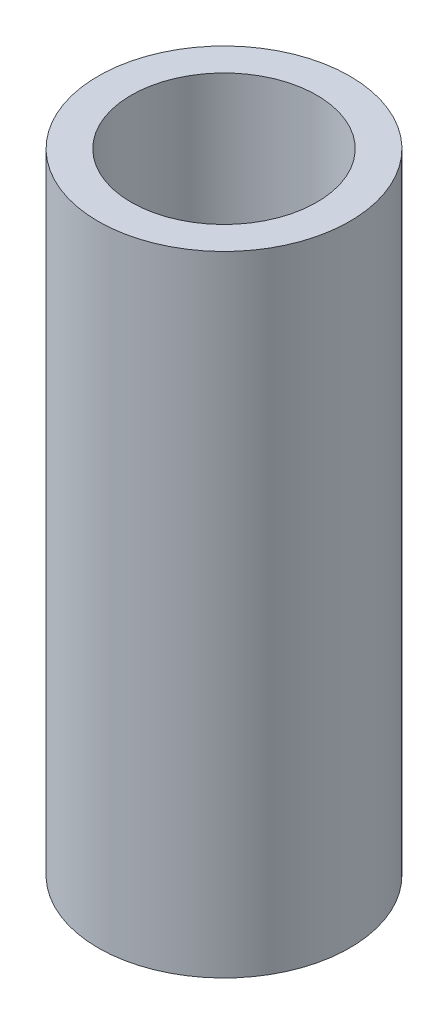
ISO-10303-21;
HEADER;
FILE_DESCRIPTION(('STEP AP214'),'2;1');
FILE_NAME('part.step','',(''),(''),'','','');
FILE_SCHEMA(('AUTOMOTIVE_DESIGN { 1 0 10303 214 1 1 1 1 }'));
ENDSEC;
DATA;
#1=APPLICATION_CONTEXT('core data for automotive mechanical design processes');
#2=APPLICATION_PROTOCOL_DEFINITION('international standard','automotive_design',2000,#1);
#3=PRODUCT_CONTEXT('',#1,'mechanical');
#4=PRODUCT('Part','Part','',(#3));
#5=PRODUCT_RELATED_PRODUCT_CATEGORY('part','',(#4));
#6=PRODUCT_DEFINITION_FORMATION('','',#4);
#7=PRODUCT_DEFINITION_CONTEXT('part definition',#1,'design');
#8=PRODUCT_DEFINITION('design','',#6,#7);
#9=PRODUCT_DEFINITION_SHAPE('','',#8);
#10=(LENGTH_UNIT() NAMED_UNIT(*) SI_UNIT(.MILLI.,.METRE.));
#11=(NAMED_UNIT(*) PLANE_ANGLE_UNIT() SI_UNIT($,.RADIAN.));
#12=(NAMED_UNIT(*) SI_UNIT($,.STERADIAN.) SOLID_ANGLE_UNIT());
#13=UNCERTAINTY_MEASURE_WITH_UNIT(LENGTH_MEASURE(1.E-05),#10,'distance_accuracy_value','');
#14=(GEOMETRIC_REPRESENTATION_CONTEXT(3) GLOBAL_UNCERTAINTY_ASSIGNED_CONTEXT((#13)) GLOBAL_UNIT_ASSIGNED_CONTEXT((#10,
#11,#12)) REPRESENTATION_CONTEXT('',''));
#15=CARTESIAN_POINT('',(0.,0.,0.));
#16=DIRECTION('',(0.,0.,1.));
#17=DIRECTION('',(1.,0.,0.));
#18=AXIS2_PLACEMENT_3D('',#15,#16,#17);
#19=CARTESIAN_POINT('',(0.,20.,0.));
#20=DIRECTION('',(0.,1.,0.));
#21=DIRECTION('',(0.,0.,1.));
#22=AXIS2_PLACEMENT_3D('',#19,#20,#21);
#23=PLANE('',#22);
#24=CARTESIAN_POINT('',(0.,20.,0.));
#25=DIRECTION('',(0.,1.,0.));
#26=DIRECTION('',(0.,0.,1.));
#27=AXIS2_PLACEMENT_3D('',#24,#25,#26);
#28=CIRCLE('',#27,4.);
#29=CARTESIAN_POINT('',(0.,20.,4.));
#30=VERTEX_POINT('',#29);
#31=EDGE_CURVE('E10',#30,#30,#28,.T.);
#32=ORIENTED_EDGE('',*,*,#31,.T.);
#33=EDGE_LOOP('',(#32));
#34=FACE_BOUND('',#33,.T.);
#35=CARTESIAN_POINT('',(0.,20.,0.));
#36=DIRECTION('',(0.,1.,0.));
#37=DIRECTION('',(0.,0.,1.));
#38=AXIS2_PLACEMENT_3D('',#35,#36,#37);
#39=CIRCLE('',#38,2.95);
#40=CARTESIAN_POINT('',(0.,20.,2.95));
#41=VERTEX_POINT('',#40);
#42=EDGE_CURVE('E43',#41,#41,#39,.T.);
#43=ORIENTED_EDGE('',*,*,#42,.F.);
#44=EDGE_LOOP('',(#43));
#45=FACE_BOUND('',#44,.T.);
#46=ADVANCED_FACE('F32',(#34,#45),#23,.T.);
#47=CARTESIAN_POINT('',(0.,0.,0.));
#48=DIRECTION('',(0.,1.,0.));
#49=DIRECTION('',(0.,0.,1.));
#50=AXIS2_PLACEMENT_3D('',#47,#48,#49);
#51=PLANE('',#50);
#52=CARTESIAN_POINT('',(0.,0.,0.));
#53=DIRECTION('',(0.,1.,0.));
#54=DIRECTION('',(0.,0.,1.));
#55=AXIS2_PLACEMENT_3D('',#52,#53,#54);
#56=CIRCLE('',#55,4.);
#57=CARTESIAN_POINT('',(0.,0.,4.));
#58=VERTEX_POINT('',#57);
#59=EDGE_CURVE('E36',#58,#58,#56,.T.);
#60=ORIENTED_EDGE('',*,*,#59,.F.);
#61=EDGE_LOOP('',(#60));
#62=FACE_BOUND('',#61,.T.);
#63=CARTESIAN_POINT('',(0.,0.,0.));
#64=DIRECTION('',(0.,1.,0.));
#65=DIRECTION('',(0.,0.,1.));
#66=AXIS2_PLACEMENT_3D('',#63,#64,#65);
#67=CIRCLE('',#66,2.95);
#68=CARTESIAN_POINT('',(0.,0.,2.95));
#69=VERTEX_POINT('',#68);
#70=EDGE_CURVE('E45',#69,#69,#67,.T.);
#71=ORIENTED_EDGE('',*,*,#70,.T.);
#72=EDGE_LOOP('',(#71));
#73=FACE_BOUND('',#72,.T.);
#74=ADVANCED_FACE('F55',(#62,#73),#51,.F.);
#75=CARTESIAN_POINT('',(0.,20.,0.));
#76=DIRECTION('',(0.,-1.,0.));
#77=DIRECTION('',(0.,0.,-1.));
#78=AXIS2_PLACEMENT_3D('',#75,#76,#77);
#79=CYLINDRICAL_SURFACE('',#78,4.);
#80=ORIENTED_EDGE('',*,*,#31,.F.);
#81=EDGE_LOOP('',(#80));
#82=FACE_BOUND('',#81,.T.);
#83=ORIENTED_EDGE('',*,*,#59,.T.);
#84=EDGE_LOOP('',(#83));
#85=FACE_BOUND('',#84,.T.);
#86=ADVANCED_FACE('F34',(#82,#85),#79,.T.);
#87=CARTESIAN_POINT('',(0.,20.,0.));
#88=DIRECTION('',(0.,-1.,0.));
#89=DIRECTION('',(0.,0.,-1.));
#90=AXIS2_PLACEMENT_3D('',#87,#88,#89);
#91=CYLINDRICAL_SURFACE('',#90,2.95);
#92=ORIENTED_EDGE('',*,*,#42,.T.);
#93=EDGE_LOOP('',(#92));
#94=FACE_BOUND('',#93,.T.);
#95=ORIENTED_EDGE('',*,*,#70,.F.);
#96=EDGE_LOOP('',(#95));
#97=FACE_BOUND('',#96,.T.);
#98=ADVANCED_FACE('F51',(#94,#97),#91,.F.);
#99=CLOSED_SHELL('',(#46,#74,#86,#98));
#100=MANIFOLD_SOLID_BREP('B2',#99);
#101=ADVANCED_BREP_SHAPE_REPRESENTATION('',(#18,#100),#14);
#102=SHAPE_DEFINITION_REPRESENTATION(#9,#101);
ENDSEC;
END-ISO-10303-21;
